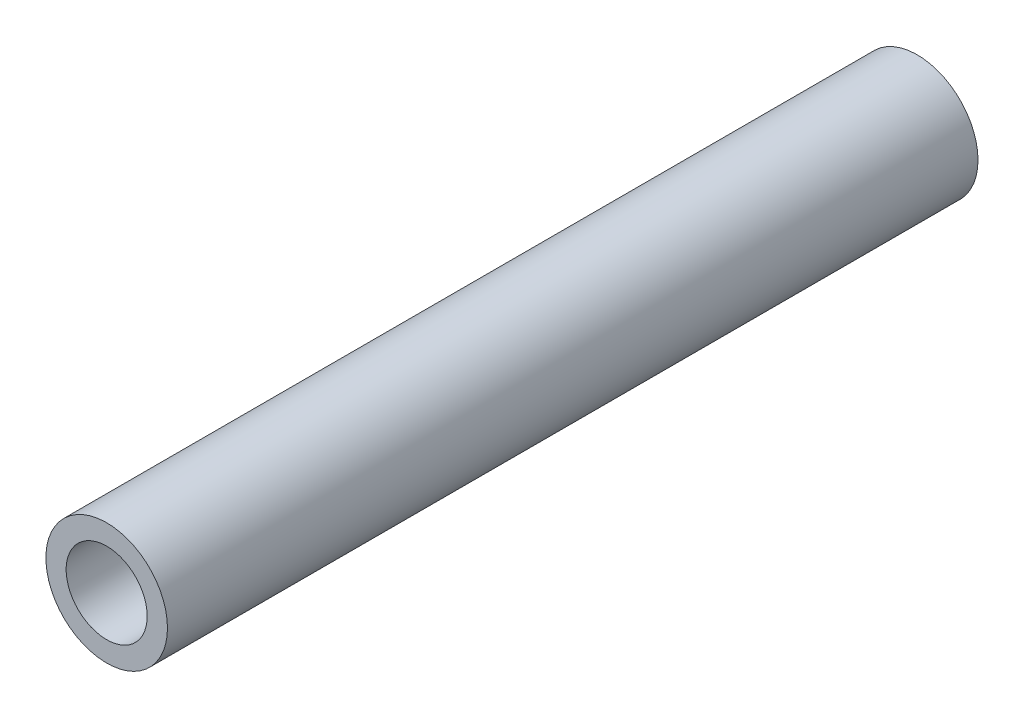
ISO-10303-21;
HEADER;
FILE_DESCRIPTION(('STEP AP214'),'2;1');
FILE_NAME('part.step','',(''),(''),'','','');
FILE_SCHEMA(('AUTOMOTIVE_DESIGN { 1 0 10303 214 1 1 1 1 }'));
ENDSEC;
DATA;
#1=APPLICATION_CONTEXT('core data for automotive mechanical design processes');
#2=APPLICATION_PROTOCOL_DEFINITION('international standard','automotive_design',2000,#1);
#3=PRODUCT_CONTEXT('',#1,'mechanical');
#4=PRODUCT('Part','Part','',(#3));
#5=PRODUCT_RELATED_PRODUCT_CATEGORY('part','',(#4));
#6=PRODUCT_DEFINITION_FORMATION('','',#4);
#7=PRODUCT_DEFINITION_CONTEXT('part definition',#1,'design');
#8=PRODUCT_DEFINITION('design','',#6,#7);
#9=PRODUCT_DEFINITION_SHAPE('','',#8);
#10=(LENGTH_UNIT() NAMED_UNIT(*) SI_UNIT(.MILLI.,.METRE.));
#11=(NAMED_UNIT(*) PLANE_ANGLE_UNIT() SI_UNIT($,.RADIAN.));
#12=(NAMED_UNIT(*) SI_UNIT($,.STERADIAN.) SOLID_ANGLE_UNIT());
#13=UNCERTAINTY_MEASURE_WITH_UNIT(LENGTH_MEASURE(1.E-05),#10,'distance_accuracy_value','');
#14=(GEOMETRIC_REPRESENTATION_CONTEXT(3) GLOBAL_UNCERTAINTY_ASSIGNED_CONTEXT((#13)) GLOBAL_UNIT_ASSIGNED_CONTEXT((#10,
#11,#12)) REPRESENTATION_CONTEXT('',''));
#15=CARTESIAN_POINT('',(0.,0.,0.));
#16=DIRECTION('',(0.,0.,1.));
#17=DIRECTION('',(1.,0.,0.));
#18=AXIS2_PLACEMENT_3D('',#15,#16,#17);
#19=CARTESIAN_POINT('',(0.,0.,20.));
#20=DIRECTION('',(0.,0.,1.));
#21=DIRECTION('',(1.,0.,0.));
#22=AXIS2_PLACEMENT_3D('',#19,#20,#21);
#23=PLANE('',#22);
#24=CARTESIAN_POINT('',(0.,0.,20.));
#25=DIRECTION('',(0.,0.,1.));
#26=DIRECTION('',(1.,0.,0.));
#27=AXIS2_PLACEMENT_3D('',#24,#25,#26);
#28=CIRCLE('',#27,1.5);
#29=CARTESIAN_POINT('',(1.5,0.,20.));
#30=VERTEX_POINT('',#29);
#31=EDGE_CURVE('E10',#30,#30,#28,.T.);
#32=ORIENTED_EDGE('',*,*,#31,.T.);
#33=EDGE_LOOP('',(#32));
#34=FACE_BOUND('',#33,.T.);
#35=CARTESIAN_POINT('',(0.,0.,20.));
#36=DIRECTION('',(0.,0.,1.));
#37=DIRECTION('',(1.,0.,0.));
#38=AXIS2_PLACEMENT_3D('',#35,#36,#37);
#39=CIRCLE('',#38,1.);
#40=CARTESIAN_POINT('',(1.,0.,20.));
#41=VERTEX_POINT('',#40);
#42=EDGE_CURVE('E46',#41,#41,#39,.T.);
#43=ORIENTED_EDGE('',*,*,#42,.F.);
#44=EDGE_LOOP('',(#43));
#45=FACE_BOUND('',#44,.T.);
#46=ADVANCED_FACE('F35',(#34,#45),#23,.T.);
#47=CARTESIAN_POINT('',(0.,0.,0.));
#48=DIRECTION('',(0.,0.,1.));
#49=DIRECTION('',(1.,0.,0.));
#50=AXIS2_PLACEMENT_3D('',#47,#48,#49);
#51=PLANE('',#50);
#52=CARTESIAN_POINT('',(0.,0.,0.));
#53=DIRECTION('',(0.,0.,1.));
#54=DIRECTION('',(1.,0.,0.));
#55=AXIS2_PLACEMENT_3D('',#52,#53,#54);
#56=CIRCLE('',#55,1.5);
#57=CARTESIAN_POINT('',(1.5,0.,0.));
#58=VERTEX_POINT('',#57);
#59=EDGE_CURVE('E39',#58,#58,#56,.T.);
#60=ORIENTED_EDGE('',*,*,#59,.F.);
#61=EDGE_LOOP('',(#60));
#62=FACE_BOUND('',#61,.T.);
#63=CARTESIAN_POINT('',(0.,0.,0.));
#64=DIRECTION('',(0.,0.,1.));
#65=DIRECTION('',(1.,0.,0.));
#66=AXIS2_PLACEMENT_3D('',#63,#64,#65);
#67=CIRCLE('',#66,1.);
#68=CARTESIAN_POINT('',(1.,0.,0.));
#69=VERTEX_POINT('',#68);
#70=EDGE_CURVE('E48',#69,#69,#67,.T.);
#71=ORIENTED_EDGE('',*,*,#70,.T.);
#72=EDGE_LOOP('',(#71));
#73=FACE_BOUND('',#72,.T.);
#74=ADVANCED_FACE('F58',(#62,#73),#51,.F.);
#75=CARTESIAN_POINT('',(0.,0.,20.));
#76=DIRECTION('',(0.,0.,-1.));
#77=DIRECTION('',(-1.,0.,0.));
#78=AXIS2_PLACEMENT_3D('',#75,#76,#77);
#79=CYLINDRICAL_SURFACE('',#78,1.5);
#80=ORIENTED_EDGE('',*,*,#31,.F.);
#81=EDGE_LOOP('',(#80));
#82=FACE_BOUND('',#81,.T.);
#83=ORIENTED_EDGE('',*,*,#59,.T.);
#84=EDGE_LOOP('',(#83));
#85=FACE_BOUND('',#84,.T.);
#86=ADVANCED_FACE('F37',(#82,#85),#79,.T.);
#87=CARTESIAN_POINT('',(0.,0.,20.));
#88=DIRECTION('',(0.,0.,-1.));
#89=DIRECTION('',(-1.,0.,0.));
#90=AXIS2_PLACEMENT_3D('',#87,#88,#89);
#91=CYLINDRICAL_SURFACE('',#90,1.);
#92=ORIENTED_EDGE('',*,*,#42,.T.);
#93=EDGE_LOOP('',(#92));
#94=FACE_BOUND('',#93,.T.);
#95=ORIENTED_EDGE('',*,*,#70,.F.);
#96=EDGE_LOOP('',(#95));
#97=FACE_BOUND('',#96,.T.);
#98=ADVANCED_FACE('F54',(#94,#97),#91,.F.);
#99=CLOSED_SHELL('',(#46,#74,#86,#98));
#100=MANIFOLD_SOLID_BREP('B2',#99);
#101=ADVANCED_BREP_SHAPE_REPRESENTATION('',(#18,#100),#14);
#102=SHAPE_DEFINITION_REPRESENTATION(#9,#101);
ENDSEC;
END-ISO-10303-21;
